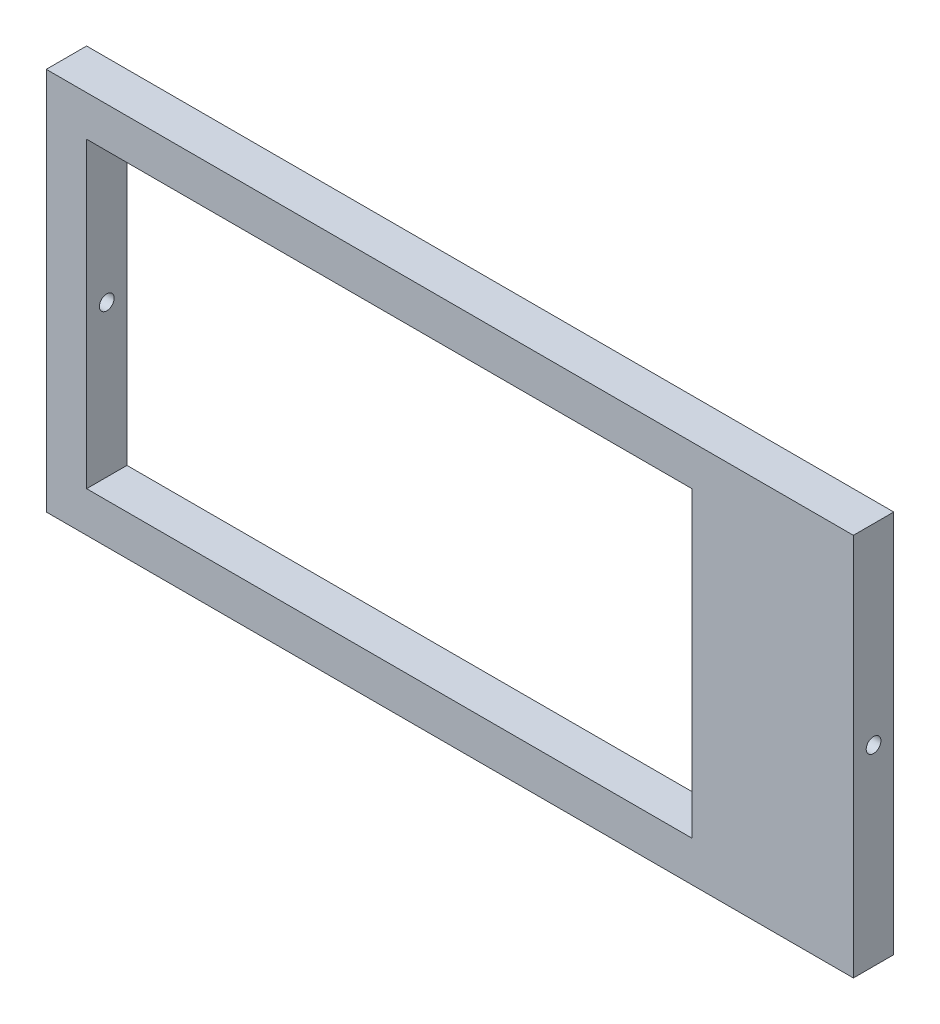
ISO-10303-21;
HEADER;
FILE_DESCRIPTION(('STEP AP214'),'2;1');
FILE_NAME('part.step','',(''),(''),'','','');
FILE_SCHEMA(('AUTOMOTIVE_DESIGN { 1 0 10303 214 1 1 1 1 }'));
ENDSEC;
DATA;
#1=APPLICATION_CONTEXT('core data for automotive mechanical design processes');
#2=APPLICATION_PROTOCOL_DEFINITION('international standard','automotive_design',2000,#1);
#3=PRODUCT_CONTEXT('',#1,'mechanical');
#4=PRODUCT('Part','Part','',(#3));
#5=PRODUCT_RELATED_PRODUCT_CATEGORY('part','',(#4));
#6=PRODUCT_DEFINITION_FORMATION('','',#4);
#7=PRODUCT_DEFINITION_CONTEXT('part definition',#1,'design');
#8=PRODUCT_DEFINITION('design','',#6,#7);
#9=PRODUCT_DEFINITION_SHAPE('','',#8);
#10=(LENGTH_UNIT() NAMED_UNIT(*) SI_UNIT(.MILLI.,.METRE.));
#11=(NAMED_UNIT(*) PLANE_ANGLE_UNIT() SI_UNIT($,.RADIAN.));
#12=(NAMED_UNIT(*) SI_UNIT($,.STERADIAN.) SOLID_ANGLE_UNIT());
#13=UNCERTAINTY_MEASURE_WITH_UNIT(LENGTH_MEASURE(1.E-05),#10,'distance_accuracy_value','');
#14=(GEOMETRIC_REPRESENTATION_CONTEXT(3) GLOBAL_UNCERTAINTY_ASSIGNED_CONTEXT((#13)) GLOBAL_UNIT_ASSIGNED_CONTEXT((#10,
#11,#12)) REPRESENTATION_CONTEXT('',''));
#15=CARTESIAN_POINT('',(0.,0.,0.));
#16=DIRECTION('',(0.,0.,1.));
#17=DIRECTION('',(1.,0.,0.));
#18=AXIS2_PLACEMENT_3D('',#15,#16,#17);
#19=CARTESIAN_POINT('',(0.,0.,2.));
#20=DIRECTION('',(0.,0.,-1.));
#21=DIRECTION('',(-1.,0.,0.));
#22=AXIS2_PLACEMENT_3D('',#19,#20,#21);
#23=PLANE('',#22);
#24=DIRECTION('',(0.,-1.,0.));
#25=VECTOR('',#24,1.);
#26=CARTESIAN_POINT('',(0.,0.,2.));
#27=LINE('',#26,#25);
#28=CARTESIAN_POINT('',(0.,19.,2.));
#29=VERTEX_POINT('',#28);
#30=CARTESIAN_POINT('',(0.,0.,2.));
#31=VERTEX_POINT('',#30);
#32=EDGE_CURVE('E156',#29,#31,#27,.T.);
#33=ORIENTED_EDGE('',*,*,#32,.T.);
#34=DIRECTION('',(1.,0.,0.));
#35=VECTOR('',#34,1.);
#36=CARTESIAN_POINT('',(0.,0.,2.));
#37=LINE('',#36,#35);
#38=CARTESIAN_POINT('',(40.,0.,2.));
#39=VERTEX_POINT('',#38);
#40=EDGE_CURVE('E160',#31,#39,#37,.T.);
#41=ORIENTED_EDGE('',*,*,#40,.T.);
#42=DIRECTION('',(0.,1.,0.));
#43=VECTOR('',#42,1.);
#44=CARTESIAN_POINT('',(40.,0.,2.));
#45=LINE('',#44,#43);
#46=CARTESIAN_POINT('',(40.,19.,2.));
#47=VERTEX_POINT('',#46);
#48=EDGE_CURVE('E164',#39,#47,#45,.T.);
#49=ORIENTED_EDGE('',*,*,#48,.T.);
#50=DIRECTION('',(-1.,0.,0.));
#51=VECTOR('',#50,1.);
#52=CARTESIAN_POINT('',(0.,19.,2.));
#53=LINE('',#52,#51);
#54=EDGE_CURVE('E167',#47,#29,#53,.T.);
#55=ORIENTED_EDGE('',*,*,#54,.T.);
#56=EDGE_LOOP('',(#33,#41,#49,#55));
#57=FACE_BOUND('',#56,.T.);
#58=DIRECTION('',(0.,-1.,0.));
#59=VECTOR('',#58,1.);
#60=CARTESIAN_POINT('',(2.,17.,2.));
#61=LINE('',#60,#59);
#62=CARTESIAN_POINT('',(2.,17.,2.));
#63=VERTEX_POINT('',#62);
#64=CARTESIAN_POINT('',(2.,2.,2.));
#65=VERTEX_POINT('',#64);
#66=EDGE_CURVE('E106',#63,#65,#61,.T.);
#67=ORIENTED_EDGE('',*,*,#66,.F.);
#68=DIRECTION('',(-1.,0.,0.));
#69=VECTOR('',#68,1.);
#70=CARTESIAN_POINT('',(2.,17.,2.));
#71=LINE('',#70,#69);
#72=CARTESIAN_POINT('',(32.,17.,2.));
#73=VERTEX_POINT('',#72);
#74=EDGE_CURVE('E132',#73,#63,#71,.T.);
#75=ORIENTED_EDGE('',*,*,#74,.F.);
#76=DIRECTION('',(0.,1.,0.));
#77=VECTOR('',#76,1.);
#78=CARTESIAN_POINT('',(32.,17.,2.));
#79=LINE('',#78,#77);
#80=CARTESIAN_POINT('',(32.,2.,2.));
#81=VERTEX_POINT('',#80);
#82=EDGE_CURVE('E128',#81,#73,#79,.T.);
#83=ORIENTED_EDGE('',*,*,#82,.F.);
#84=DIRECTION('',(1.,0.,0.));
#85=VECTOR('',#84,1.);
#86=CARTESIAN_POINT('',(2.,2.,2.));
#87=LINE('',#86,#85);
#88=EDGE_CURVE('E115',#65,#81,#87,.T.);
#89=ORIENTED_EDGE('',*,*,#88,.F.);
#90=EDGE_LOOP('',(#67,#75,#83,#89));
#91=FACE_BOUND('',#90,.T.);
#92=ADVANCED_FACE('F39',(#57,#91),#23,.F.);
#93=CARTESIAN_POINT('',(0.,0.,0.));
#94=DIRECTION('',(0.,0.,-1.));
#95=DIRECTION('',(-1.,0.,0.));
#96=AXIS2_PLACEMENT_3D('',#93,#94,#95);
#97=PLANE('',#96);
#98=DIRECTION('',(0.,-1.,0.));
#99=VECTOR('',#98,1.);
#100=CARTESIAN_POINT('',(0.,0.,0.));
#101=LINE('',#100,#99);
#102=CARTESIAN_POINT('',(0.,19.,0.));
#103=VERTEX_POINT('',#102);
#104=CARTESIAN_POINT('',(0.,0.,0.));
#105=VERTEX_POINT('',#104);
#106=EDGE_CURVE('E124',#103,#105,#101,.T.);
#107=ORIENTED_EDGE('',*,*,#106,.F.);
#108=DIRECTION('',(-1.,0.,0.));
#109=VECTOR('',#108,1.);
#110=CARTESIAN_POINT('',(0.,19.,0.));
#111=LINE('',#110,#109);
#112=CARTESIAN_POINT('',(40.,19.,0.));
#113=VERTEX_POINT('',#112);
#114=EDGE_CURVE('E161',#113,#103,#111,.T.);
#115=ORIENTED_EDGE('',*,*,#114,.F.);
#116=DIRECTION('',(0.,1.,0.));
#117=VECTOR('',#116,1.);
#118=CARTESIAN_POINT('',(40.,0.,0.));
#119=LINE('',#118,#117);
#120=CARTESIAN_POINT('',(40.,0.,0.));
#121=VERTEX_POINT('',#120);
#122=EDGE_CURVE('E177',#121,#113,#119,.T.);
#123=ORIENTED_EDGE('',*,*,#122,.F.);
#124=DIRECTION('',(1.,0.,0.));
#125=VECTOR('',#124,1.);
#126=CARTESIAN_POINT('',(0.,0.,0.));
#127=LINE('',#126,#125);
#128=EDGE_CURVE('E174',#105,#121,#127,.T.);
#129=ORIENTED_EDGE('',*,*,#128,.F.);
#130=EDGE_LOOP('',(#107,#115,#123,#129));
#131=FACE_BOUND('',#130,.T.);
#132=DIRECTION('',(-1.,0.,0.));
#133=VECTOR('',#132,1.);
#134=CARTESIAN_POINT('',(2.,17.,0.));
#135=LINE('',#134,#133);
#136=CARTESIAN_POINT('',(32.,17.,0.));
#137=VERTEX_POINT('',#136);
#138=CARTESIAN_POINT('',(2.,17.,0.));
#139=VERTEX_POINT('',#138);
#140=EDGE_CURVE('E116',#137,#139,#135,.T.);
#141=ORIENTED_EDGE('',*,*,#140,.T.);
#142=DIRECTION('',(0.,-1.,0.));
#143=VECTOR('',#142,1.);
#144=CARTESIAN_POINT('',(2.,17.,0.));
#145=LINE('',#144,#143);
#146=CARTESIAN_POINT('',(2.,2.,0.));
#147=VERTEX_POINT('',#146);
#148=EDGE_CURVE('E64',#139,#147,#145,.T.);
#149=ORIENTED_EDGE('',*,*,#148,.T.);
#150=DIRECTION('',(1.,0.,0.));
#151=VECTOR('',#150,1.);
#152=CARTESIAN_POINT('',(2.,2.,0.));
#153=LINE('',#152,#151);
#154=CARTESIAN_POINT('',(32.,2.,0.));
#155=VERTEX_POINT('',#154);
#156=EDGE_CURVE('E122',#147,#155,#153,.T.);
#157=ORIENTED_EDGE('',*,*,#156,.T.);
#158=DIRECTION('',(0.,1.,0.));
#159=VECTOR('',#158,1.);
#160=CARTESIAN_POINT('',(32.,17.,0.));
#161=LINE('',#160,#159);
#162=EDGE_CURVE('E143',#155,#137,#161,.T.);
#163=ORIENTED_EDGE('',*,*,#162,.T.);
#164=EDGE_LOOP('',(#141,#149,#157,#163));
#165=FACE_BOUND('',#164,.T.);
#166=ADVANCED_FACE('F201',(#131,#165),#97,.T.);
#167=CARTESIAN_POINT('',(0.,0.,2.));
#168=DIRECTION('',(1.,0.,0.));
#169=DIRECTION('',(0.,0.,-1.));
#170=AXIS2_PLACEMENT_3D('',#167,#168,#169);
#171=PLANE('',#170);
#172=CARTESIAN_POINT('',(0.,9.5,1.));
#173=DIRECTION('',(1.,0.,0.));
#174=DIRECTION('',(0.,0.,-1.));
#175=AXIS2_PLACEMENT_3D('',#172,#173,#174);
#176=CIRCLE('',#175,0.365);
#177=CARTESIAN_POINT('',(0.,9.5,0.635));
#178=VERTEX_POINT('',#177);
#179=EDGE_CURVE('E244',#178,#178,#176,.T.);
#180=ORIENTED_EDGE('',*,*,#179,.T.);
#181=EDGE_LOOP('',(#180));
#182=FACE_BOUND('',#181,.T.);
#183=ORIENTED_EDGE('',*,*,#106,.T.);
#184=DIRECTION('',(0.,0.,-1.));
#185=VECTOR('',#184,1.);
#186=CARTESIAN_POINT('',(0.,0.,2.));
#187=LINE('',#186,#185);
#188=EDGE_CURVE('E11',#31,#105,#187,.T.);
#189=ORIENTED_EDGE('',*,*,#188,.F.);
#190=ORIENTED_EDGE('',*,*,#32,.F.);
#191=DIRECTION('',(0.,0.,-1.));
#192=VECTOR('',#191,1.);
#193=CARTESIAN_POINT('',(0.,19.,2.));
#194=LINE('',#193,#192);
#195=EDGE_CURVE('E170',#29,#103,#194,.T.);
#196=ORIENTED_EDGE('',*,*,#195,.T.);
#197=EDGE_LOOP('',(#183,#189,#190,#196));
#198=FACE_BOUND('',#197,.T.);
#199=ADVANCED_FACE('F41',(#182,#198),#171,.F.);
#200=CARTESIAN_POINT('',(0.,0.,2.));
#201=DIRECTION('',(0.,1.,0.));
#202=DIRECTION('',(0.,0.,1.));
#203=AXIS2_PLACEMENT_3D('',#200,#201,#202);
#204=PLANE('',#203);
#205=ORIENTED_EDGE('',*,*,#128,.T.);
#206=DIRECTION('',(0.,0.,-1.));
#207=VECTOR('',#206,1.);
#208=CARTESIAN_POINT('',(40.,0.,2.));
#209=LINE('',#208,#207);
#210=EDGE_CURVE('E49',#39,#121,#209,.T.);
#211=ORIENTED_EDGE('',*,*,#210,.F.);
#212=ORIENTED_EDGE('',*,*,#40,.F.);
#213=ORIENTED_EDGE('',*,*,#188,.T.);
#214=EDGE_LOOP('',(#205,#211,#212,#213));
#215=FACE_BOUND('',#214,.T.);
#216=ADVANCED_FACE('F211',(#215),#204,.F.);
#217=CARTESIAN_POINT('',(40.,0.,2.));
#218=DIRECTION('',(-1.,0.,0.));
#219=DIRECTION('',(0.,0.,1.));
#220=AXIS2_PLACEMENT_3D('',#217,#218,#219);
#221=PLANE('',#220);
#222=CARTESIAN_POINT('',(40.,9.5,1.));
#223=DIRECTION('',(1.,0.,0.));
#224=DIRECTION('',(0.,0.,-1.));
#225=AXIS2_PLACEMENT_3D('',#222,#223,#224);
#226=CIRCLE('',#225,0.365);
#227=CARTESIAN_POINT('',(40.,9.5,0.635));
#228=VERTEX_POINT('',#227);
#229=EDGE_CURVE('E246',#228,#228,#226,.T.);
#230=ORIENTED_EDGE('',*,*,#229,.F.);
#231=EDGE_LOOP('',(#230));
#232=FACE_BOUND('',#231,.T.);
#233=ORIENTED_EDGE('',*,*,#122,.T.);
#234=DIRECTION('',(0.,0.,-1.));
#235=VECTOR('',#234,1.);
#236=CARTESIAN_POINT('',(40.,19.,2.));
#237=LINE('',#236,#235);
#238=EDGE_CURVE('E185',#47,#113,#237,.T.);
#239=ORIENTED_EDGE('',*,*,#238,.F.);
#240=ORIENTED_EDGE('',*,*,#48,.F.);
#241=ORIENTED_EDGE('',*,*,#210,.T.);
#242=EDGE_LOOP('',(#233,#239,#240,#241));
#243=FACE_BOUND('',#242,.T.);
#244=ADVANCED_FACE('F195',(#232,#243),#221,.F.);
#245=CARTESIAN_POINT('',(0.,19.,2.));
#246=DIRECTION('',(0.,-1.,0.));
#247=DIRECTION('',(0.,0.,-1.));
#248=AXIS2_PLACEMENT_3D('',#245,#246,#247);
#249=PLANE('',#248);
#250=ORIENTED_EDGE('',*,*,#114,.T.);
#251=ORIENTED_EDGE('',*,*,#195,.F.);
#252=ORIENTED_EDGE('',*,*,#54,.F.);
#253=ORIENTED_EDGE('',*,*,#238,.T.);
#254=EDGE_LOOP('',(#250,#251,#252,#253));
#255=FACE_BOUND('',#254,.T.);
#256=ADVANCED_FACE('F205',(#255),#249,.F.);
#257=CARTESIAN_POINT('',(2.,17.,2.));
#258=DIRECTION('',(1.,0.,0.));
#259=DIRECTION('',(0.,1.,0.));
#260=AXIS2_PLACEMENT_3D('',#257,#258,#259);
#261=PLANE('',#260);
#262=CARTESIAN_POINT('',(2.,9.5,1.));
#263=DIRECTION('',(1.,0.,0.));
#264=DIRECTION('',(0.,1.,0.));
#265=AXIS2_PLACEMENT_3D('',#262,#263,#264);
#266=CIRCLE('',#265,0.365);
#267=CARTESIAN_POINT('',(2.,9.865,1.));
#268=VERTEX_POINT('',#267);
#269=EDGE_CURVE('E140',#268,#268,#266,.T.);
#270=ORIENTED_EDGE('',*,*,#269,.F.);
#271=EDGE_LOOP('',(#270));
#272=FACE_BOUND('',#271,.T.);
#273=ORIENTED_EDGE('',*,*,#148,.F.);
#274=DIRECTION('',(0.,0.,-1.));
#275=VECTOR('',#274,1.);
#276=CARTESIAN_POINT('',(2.,17.,2.));
#277=LINE('',#276,#275);
#278=EDGE_CURVE('E110',#63,#139,#277,.T.);
#279=ORIENTED_EDGE('',*,*,#278,.F.);
#280=ORIENTED_EDGE('',*,*,#66,.T.);
#281=DIRECTION('',(0.,0.,-1.));
#282=VECTOR('',#281,1.);
#283=CARTESIAN_POINT('',(2.,2.,2.));
#284=LINE('',#283,#282);
#285=EDGE_CURVE('E109',#65,#147,#284,.T.);
#286=ORIENTED_EDGE('',*,*,#285,.T.);
#287=EDGE_LOOP('',(#273,#279,#280,#286));
#288=FACE_BOUND('',#287,.T.);
#289=ADVANCED_FACE('F108',(#272,#288),#261,.T.);
#290=CARTESIAN_POINT('',(2.,2.,2.));
#291=DIRECTION('',(0.,1.,0.));
#292=DIRECTION('',(0.,0.,1.));
#293=AXIS2_PLACEMENT_3D('',#290,#291,#292);
#294=PLANE('',#293);
#295=ORIENTED_EDGE('',*,*,#156,.F.);
#296=ORIENTED_EDGE('',*,*,#285,.F.);
#297=ORIENTED_EDGE('',*,*,#88,.T.);
#298=DIRECTION('',(0.,0.,-1.));
#299=VECTOR('',#298,1.);
#300=CARTESIAN_POINT('',(32.,2.,2.));
#301=LINE('',#300,#299);
#302=EDGE_CURVE('E125',#81,#155,#301,.T.);
#303=ORIENTED_EDGE('',*,*,#302,.T.);
#304=EDGE_LOOP('',(#295,#296,#297,#303));
#305=FACE_BOUND('',#304,.T.);
#306=ADVANCED_FACE('F119',(#305),#294,.T.);
#307=CARTESIAN_POINT('',(32.,17.,2.));
#308=DIRECTION('',(-1.,0.,0.));
#309=DIRECTION('',(0.,0.,1.));
#310=AXIS2_PLACEMENT_3D('',#307,#308,#309);
#311=PLANE('',#310);
#312=CARTESIAN_POINT('',(32.,9.5,1.));
#313=DIRECTION('',(-1.,0.,0.));
#314=DIRECTION('',(0.,0.,1.));
#315=AXIS2_PLACEMENT_3D('',#312,#313,#314);
#316=CIRCLE('',#315,0.365);
#317=CARTESIAN_POINT('',(32.,9.5,1.365));
#318=VERTEX_POINT('',#317);
#319=EDGE_CURVE('E43',#318,#318,#316,.T.);
#320=ORIENTED_EDGE('',*,*,#319,.F.);
#321=EDGE_LOOP('',(#320));
#322=FACE_BOUND('',#321,.T.);
#323=ORIENTED_EDGE('',*,*,#162,.F.);
#324=ORIENTED_EDGE('',*,*,#302,.F.);
#325=ORIENTED_EDGE('',*,*,#82,.T.);
#326=DIRECTION('',(0.,0.,-1.));
#327=VECTOR('',#326,1.);
#328=CARTESIAN_POINT('',(32.,17.,2.));
#329=LINE('',#328,#327);
#330=EDGE_CURVE('E56',#73,#137,#329,.T.);
#331=ORIENTED_EDGE('',*,*,#330,.T.);
#332=EDGE_LOOP('',(#323,#324,#325,#331));
#333=FACE_BOUND('',#332,.T.);
#334=ADVANCED_FACE('F237',(#322,#333),#311,.T.);
#335=CARTESIAN_POINT('',(2.,17.,2.));
#336=DIRECTION('',(0.,-1.,0.));
#337=DIRECTION('',(0.,0.,-1.));
#338=AXIS2_PLACEMENT_3D('',#335,#336,#337);
#339=PLANE('',#338);
#340=ORIENTED_EDGE('',*,*,#140,.F.);
#341=ORIENTED_EDGE('',*,*,#330,.F.);
#342=ORIENTED_EDGE('',*,*,#74,.T.);
#343=ORIENTED_EDGE('',*,*,#278,.T.);
#344=EDGE_LOOP('',(#340,#341,#342,#343));
#345=FACE_BOUND('',#344,.T.);
#346=ADVANCED_FACE('F261',(#345),#339,.T.);
#347=CARTESIAN_POINT('',(0.,9.5,1.));
#348=DIRECTION('',(1.,0.,0.));
#349=DIRECTION('',(0.,0.,-1.));
#350=AXIS2_PLACEMENT_3D('',#347,#348,#349);
#351=CYLINDRICAL_SURFACE('',#350,0.365);
#352=ORIENTED_EDGE('',*,*,#319,.T.);
#353=EDGE_LOOP('',(#352));
#354=FACE_BOUND('',#353,.T.);
#355=ORIENTED_EDGE('',*,*,#229,.T.);
#356=EDGE_LOOP('',(#355));
#357=FACE_BOUND('',#356,.T.);
#358=ADVANCED_FACE('F256',(#354,#357),#351,.F.);
#359=ORIENTED_EDGE('',*,*,#269,.T.);
#360=EDGE_LOOP('',(#359));
#361=FACE_BOUND('',#360,.T.);
#362=ORIENTED_EDGE('',*,*,#179,.F.);
#363=EDGE_LOOP('',(#362));
#364=FACE_BOUND('',#363,.T.);
#365=ADVANCED_FACE('F254',(#361,#364),#351,.F.);
#366=CLOSED_SHELL('',(#92,#166,#199,#216,#244,#256,#289,#306,#334,#346,#358,#365));
#367=MANIFOLD_SOLID_BREP('B2',#366);
#368=ADVANCED_BREP_SHAPE_REPRESENTATION('',(#18,#367),#14);
#369=SHAPE_DEFINITION_REPRESENTATION(#9,#368);
ENDSEC;
END-ISO-10303-21;
